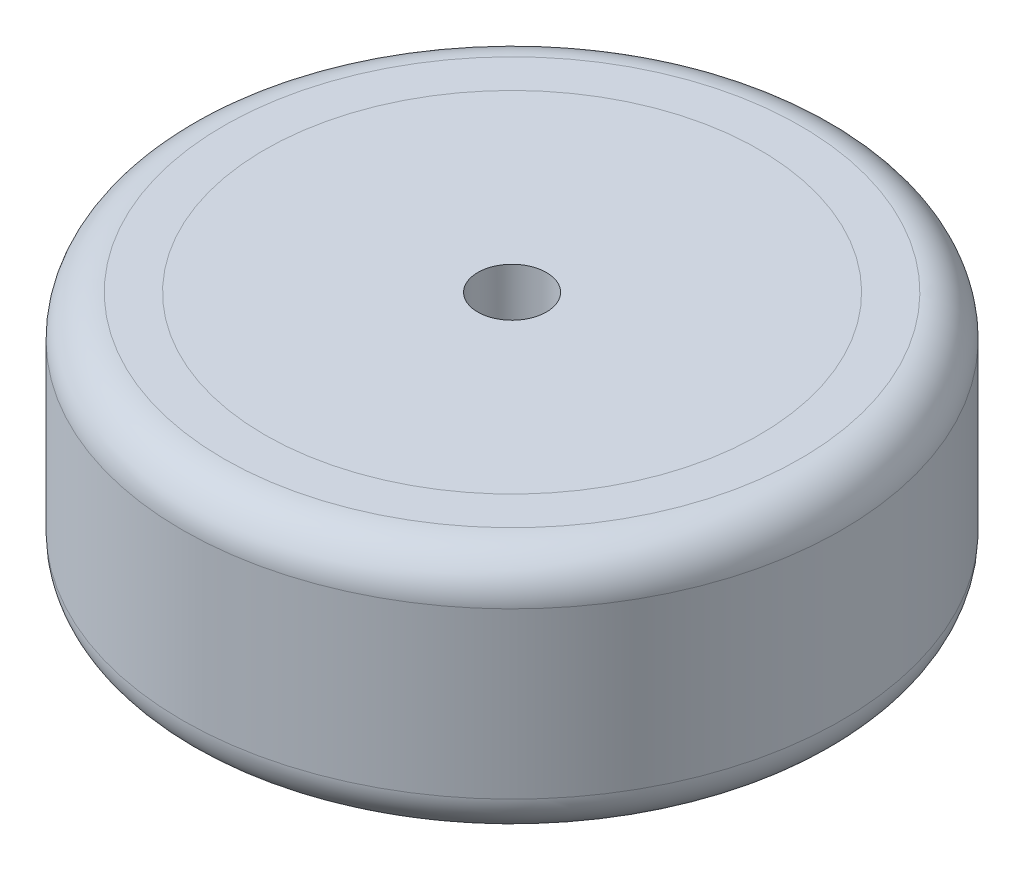
ISO-10303-21;
HEADER;
FILE_DESCRIPTION(('STEP AP214'),'2;1');
FILE_NAME('part.step','',(''),(''),'','','');
FILE_SCHEMA(('AUTOMOTIVE_DESIGN { 1 0 10303 214 1 1 1 1 }'));
ENDSEC;
DATA;
#1=APPLICATION_CONTEXT('core data for automotive mechanical design processes');
#2=APPLICATION_PROTOCOL_DEFINITION('international standard','automotive_design',2000,#1);
#3=PRODUCT_CONTEXT('',#1,'mechanical');
#4=PRODUCT('Part','Part','',(#3));
#5=PRODUCT_RELATED_PRODUCT_CATEGORY('part','',(#4));
#6=PRODUCT_DEFINITION_FORMATION('','',#4);
#7=PRODUCT_DEFINITION_CONTEXT('part definition',#1,'design');
#8=PRODUCT_DEFINITION('design','',#6,#7);
#9=PRODUCT_DEFINITION_SHAPE('','',#8);
#10=(LENGTH_UNIT() NAMED_UNIT(*) SI_UNIT(.MILLI.,.METRE.));
#11=(NAMED_UNIT(*) PLANE_ANGLE_UNIT() SI_UNIT($,.RADIAN.));
#12=(NAMED_UNIT(*) SI_UNIT($,.STERADIAN.) SOLID_ANGLE_UNIT());
#13=UNCERTAINTY_MEASURE_WITH_UNIT(LENGTH_MEASURE(1.E-05),#10,'distance_accuracy_value','');
#14=(GEOMETRIC_REPRESENTATION_CONTEXT(3) GLOBAL_UNCERTAINTY_ASSIGNED_CONTEXT((#13)) GLOBAL_UNIT_ASSIGNED_CONTEXT((#10,
#11,#12)) REPRESENTATION_CONTEXT('',''));
#15=CARTESIAN_POINT('',(0.,0.,0.));
#16=DIRECTION('',(0.,0.,1.));
#17=DIRECTION('',(1.,0.,0.));
#18=AXIS2_PLACEMENT_3D('',#15,#16,#17);
#19=CARTESIAN_POINT('',(0.,0.,0.));
#20=DIRECTION('',(0.,1.,0.));
#21=DIRECTION('',(0.,0.,1.));
#22=AXIS2_PLACEMENT_3D('',#19,#20,#21);
#23=CYLINDRICAL_SURFACE('',#22,18.);
#24=CARTESIAN_POINT('',(0.,0.,0.));
#25=DIRECTION('',(0.,-1.,0.));
#26=DIRECTION('',(0.,0.,-1.));
#27=AXIS2_PLACEMENT_3D('',#24,#25,#26);
#28=CIRCLE('',#27,18.);
#29=CARTESIAN_POINT('',(0.,0.,-18.));
#30=VERTEX_POINT('',#29);
#31=EDGE_CURVE('E11',#30,#30,#28,.T.);
#32=ORIENTED_EDGE('',*,*,#31,.F.);
#33=EDGE_LOOP('',(#32));
#34=FACE_BOUND('',#33,.T.);
#35=CARTESIAN_POINT('',(0.,5.,0.));
#36=DIRECTION('',(0.,-1.,0.));
#37=DIRECTION('',(0.,0.,-1.));
#38=AXIS2_PLACEMENT_3D('',#35,#36,#37);
#39=CIRCLE('',#38,18.);
#40=CARTESIAN_POINT('',(0.,5.,-18.));
#41=VERTEX_POINT('',#40);
#42=EDGE_CURVE('E51',#41,#41,#39,.T.);
#43=ORIENTED_EDGE('',*,*,#42,.T.);
#44=EDGE_LOOP('',(#43));
#45=FACE_BOUND('',#44,.T.);
#46=ADVANCED_FACE('F44',(#34,#45),#23,.T.);
#47=CARTESIAN_POINT('',(0.,0.,0.));
#48=DIRECTION('',(0.,-1.,0.));
#49=DIRECTION('',(0.,0.,-1.));
#50=AXIS2_PLACEMENT_3D('',#47,#48,#49);
#51=PLANE('',#50);
#52=CARTESIAN_POINT('',(0.,0.,0.));
#53=DIRECTION('',(0.,-1.,0.));
#54=DIRECTION('',(0.,0.,-1.));
#55=AXIS2_PLACEMENT_3D('',#52,#53,#54);
#56=CIRCLE('',#55,2.5);
#57=CARTESIAN_POINT('',(0.,0.,-2.5));
#58=VERTEX_POINT('',#57);
#59=EDGE_CURVE('E57',#58,#58,#56,.T.);
#60=ORIENTED_EDGE('',*,*,#59,.F.);
#61=EDGE_LOOP('',(#60));
#62=FACE_BOUND('',#61,.T.);
#63=ORIENTED_EDGE('',*,*,#31,.T.);
#64=EDGE_LOOP('',(#63));
#65=FACE_BOUND('',#64,.T.);
#66=ADVANCED_FACE('F73',(#62,#65),#51,.T.);
#67=CARTESIAN_POINT('',(0.,5.,0.));
#68=DIRECTION('',(0.,-1.,0.));
#69=DIRECTION('',(0.,0.,-1.));
#70=AXIS2_PLACEMENT_3D('',#67,#68,#69);
#71=PLANE('',#70);
#72=CARTESIAN_POINT('',(0.,5.,0.));
#73=DIRECTION('',(0.,-1.,0.));
#74=DIRECTION('',(0.,0.,-1.));
#75=AXIS2_PLACEMENT_3D('',#72,#73,#74);
#76=CIRCLE('',#75,2.5);
#77=CARTESIAN_POINT('',(0.,5.,-2.5));
#78=VERTEX_POINT('',#77);
#79=EDGE_CURVE('E47',#78,#78,#76,.T.);
#80=ORIENTED_EDGE('',*,*,#79,.T.);
#81=EDGE_LOOP('',(#80));
#82=FACE_BOUND('',#81,.T.);
#83=ORIENTED_EDGE('',*,*,#42,.F.);
#84=EDGE_LOOP('',(#83));
#85=FACE_BOUND('',#84,.T.);
#86=ADVANCED_FACE('F64',(#82,#85),#71,.F.);
#87=CARTESIAN_POINT('',(0.,18.,0.));
#88=DIRECTION('',(0.,-1.,0.));
#89=DIRECTION('',(0.,0.,-1.));
#90=AXIS2_PLACEMENT_3D('',#87,#88,#89);
#91=CYLINDRICAL_SURFACE('',#90,2.5);
#92=ORIENTED_EDGE('',*,*,#59,.T.);
#93=EDGE_LOOP('',(#92));
#94=FACE_BOUND('',#93,.T.);
#95=ORIENTED_EDGE('',*,*,#79,.F.);
#96=EDGE_LOOP('',(#95));
#97=FACE_BOUND('',#96,.T.);
#98=ADVANCED_FACE('F67',(#94,#97),#91,.F.);
#99=CLOSED_SHELL('',(#46,#66,#86,#98));
#100=MANIFOLD_SOLID_BREP('B2',#99);
#101=CARTESIAN_POINT('',(0.,18.,0.));
#102=DIRECTION('',(0.,-1.,0.));
#103=DIRECTION('',(0.,0.,-1.));
#104=AXIS2_PLACEMENT_3D('',#101,#102,#103);
#105=CYLINDRICAL_SURFACE('',#104,18.);
#106=CARTESIAN_POINT('',(0.,18.,0.));
#107=DIRECTION('',(0.,1.,0.));
#108=DIRECTION('',(0.,0.,1.));
#109=AXIS2_PLACEMENT_3D('',#106,#107,#108);
#110=CIRCLE('',#109,18.);
#111=CARTESIAN_POINT('',(0.,18.,18.));
#112=VERTEX_POINT('',#111);
#113=EDGE_CURVE('E43',#112,#112,#110,.T.);
#114=ORIENTED_EDGE('',*,*,#113,.F.);
#115=EDGE_LOOP('',(#114));
#116=FACE_BOUND('',#115,.T.);
#117=CARTESIAN_POINT('',(0.,13.,0.));
#118=DIRECTION('',(0.,1.,0.));
#119=DIRECTION('',(0.,0.,1.));
#120=AXIS2_PLACEMENT_3D('',#117,#118,#119);
#121=CIRCLE('',#120,18.);
#122=CARTESIAN_POINT('',(0.,13.,18.));
#123=VERTEX_POINT('',#122);
#124=EDGE_CURVE('E128',#123,#123,#121,.T.);
#125=ORIENTED_EDGE('',*,*,#124,.T.);
#126=EDGE_LOOP('',(#125));
#127=FACE_BOUND('',#126,.T.);
#128=ADVANCED_FACE('F121',(#116,#127),#105,.T.);
#129=CARTESIAN_POINT('',(0.,18.,0.));
#130=DIRECTION('',(0.,1.,0.));
#131=DIRECTION('',(0.,0.,1.));
#132=AXIS2_PLACEMENT_3D('',#129,#130,#131);
#133=PLANE('',#132);
#134=CARTESIAN_POINT('',(0.,18.,0.));
#135=DIRECTION('',(0.,-1.,0.));
#136=DIRECTION('',(0.,0.,-1.));
#137=AXIS2_PLACEMENT_3D('',#134,#135,#136);
#138=CIRCLE('',#137,2.5);
#139=CARTESIAN_POINT('',(0.,18.,-2.5));
#140=VERTEX_POINT('',#139);
#141=EDGE_CURVE('E134',#140,#140,#138,.T.);
#142=ORIENTED_EDGE('',*,*,#141,.T.);
#143=EDGE_LOOP('',(#142));
#144=FACE_BOUND('',#143,.T.);
#145=ORIENTED_EDGE('',*,*,#113,.T.);
#146=EDGE_LOOP('',(#145));
#147=FACE_BOUND('',#146,.T.);
#148=ADVANCED_FACE('F151',(#144,#147),#133,.T.);
#149=CARTESIAN_POINT('',(0.,13.,0.));
#150=DIRECTION('',(0.,1.,0.));
#151=DIRECTION('',(0.,0.,1.));
#152=AXIS2_PLACEMENT_3D('',#149,#150,#151);
#153=PLANE('',#152);
#154=CARTESIAN_POINT('',(0.,13.,0.));
#155=DIRECTION('',(0.,1.,0.));
#156=DIRECTION('',(0.,0.,1.));
#157=AXIS2_PLACEMENT_3D('',#154,#155,#156);
#158=CIRCLE('',#157,2.5);
#159=CARTESIAN_POINT('',(0.,13.,2.5));
#160=VERTEX_POINT('',#159);
#161=EDGE_CURVE('E124',#160,#160,#158,.T.);
#162=ORIENTED_EDGE('',*,*,#161,.T.);
#163=EDGE_LOOP('',(#162));
#164=FACE_BOUND('',#163,.T.);
#165=ORIENTED_EDGE('',*,*,#124,.F.);
#166=EDGE_LOOP('',(#165));
#167=FACE_BOUND('',#166,.T.);
#168=ADVANCED_FACE('F141',(#164,#167),#153,.F.);
#169=CARTESIAN_POINT('',(0.,18.,0.));
#170=DIRECTION('',(0.,-1.,0.));
#171=DIRECTION('',(0.,0.,-1.));
#172=AXIS2_PLACEMENT_3D('',#169,#170,#171);
#173=CYLINDRICAL_SURFACE('',#172,2.5);
#174=ORIENTED_EDGE('',*,*,#141,.F.);
#175=EDGE_LOOP('',(#174));
#176=FACE_BOUND('',#175,.T.);
#177=ORIENTED_EDGE('',*,*,#161,.F.);
#178=EDGE_LOOP('',(#177));
#179=FACE_BOUND('',#178,.T.);
#180=ADVANCED_FACE('F144',(#176,#179),#173,.F.);
#181=CLOSED_SHELL('',(#128,#148,#168,#180));
#182=MANIFOLD_SOLID_BREP('B6',#181);
#183=CARTESIAN_POINT('',(0.,18.,0.));
#184=DIRECTION('',(0.,-1.,0.));
#185=DIRECTION('',(0.,0.,-1.));
#186=AXIS2_PLACEMENT_3D('',#183,#184,#185);
#187=CYLINDRICAL_SURFACE('',#186,24.);
#188=CARTESIAN_POINT('',(0.,15.,0.));
#189=DIRECTION('',(0.,1.,0.));
#190=DIRECTION('',(0.,0.,1.));
#191=AXIS2_PLACEMENT_3D('',#188,#189,#190);
#192=CIRCLE('',#191,24.);
#193=CARTESIAN_POINT('',(0.,15.,24.));
#194=VERTEX_POINT('',#193);
#195=EDGE_CURVE('E198',#194,#194,#192,.F.);
#196=ORIENTED_EDGE('',*,*,#195,.T.);
#197=EDGE_LOOP('',(#196));
#198=FACE_BOUND('',#197,.T.);
#199=CARTESIAN_POINT('',(0.,3.,0.));
#200=DIRECTION('',(0.,1.,0.));
#201=DIRECTION('',(0.,0.,1.));
#202=AXIS2_PLACEMENT_3D('',#199,#200,#201);
#203=CIRCLE('',#202,24.);
#204=CARTESIAN_POINT('',(0.,3.,24.));
#205=VERTEX_POINT('',#204);
#206=EDGE_CURVE('E202',#205,#205,#203,.T.);
#207=ORIENTED_EDGE('',*,*,#206,.T.);
#208=EDGE_LOOP('',(#207));
#209=FACE_BOUND('',#208,.T.);
#210=ADVANCED_FACE('F191',(#198,#209),#187,.T.);
#211=CARTESIAN_POINT('',(0.,18.,0.));
#212=DIRECTION('',(0.,1.,0.));
#213=DIRECTION('',(0.,0.,1.));
#214=AXIS2_PLACEMENT_3D('',#211,#212,#213);
#215=PLANE('',#214);
#216=CARTESIAN_POINT('',(0.,18.,0.));
#217=DIRECTION('',(0.,1.,0.));
#218=DIRECTION('',(0.,0.,1.));
#219=AXIS2_PLACEMENT_3D('',#216,#217,#218);
#220=CIRCLE('',#219,21.);
#221=CARTESIAN_POINT('',(0.,18.,21.));
#222=VERTEX_POINT('',#221);
#223=EDGE_CURVE('E206',#222,#222,#220,.T.);
#224=ORIENTED_EDGE('',*,*,#223,.T.);
#225=EDGE_LOOP('',(#224));
#226=FACE_BOUND('',#225,.T.);
#227=CARTESIAN_POINT('',(0.,18.,0.));
#228=DIRECTION('',(0.,1.,0.));
#229=DIRECTION('',(0.,0.,1.));
#230=AXIS2_PLACEMENT_3D('',#227,#228,#229);
#231=CIRCLE('',#230,18.);
#232=CARTESIAN_POINT('',(0.,18.,18.));
#233=VERTEX_POINT('',#232);
#234=EDGE_CURVE('E216',#233,#233,#231,.T.);
#235=ORIENTED_EDGE('',*,*,#234,.F.);
#236=EDGE_LOOP('',(#235));
#237=FACE_BOUND('',#236,.T.);
#238=ADVANCED_FACE('F247',(#226,#237),#215,.T.);
#239=CARTESIAN_POINT('',(0.,0.,0.));
#240=DIRECTION('',(0.,1.,0.));
#241=DIRECTION('',(0.,0.,1.));
#242=AXIS2_PLACEMENT_3D('',#239,#240,#241);
#243=PLANE('',#242);
#244=CARTESIAN_POINT('',(0.,0.,0.));
#245=DIRECTION('',(0.,1.,0.));
#246=DIRECTION('',(0.,0.,1.));
#247=AXIS2_PLACEMENT_3D('',#244,#245,#246);
#248=CIRCLE('',#247,21.);
#249=CARTESIAN_POINT('',(0.,0.,21.));
#250=VERTEX_POINT('',#249);
#251=EDGE_CURVE('E120',#250,#250,#248,.F.);
#252=ORIENTED_EDGE('',*,*,#251,.T.);
#253=EDGE_LOOP('',(#252));
#254=FACE_BOUND('',#253,.T.);
#255=CARTESIAN_POINT('',(0.,0.,0.));
#256=DIRECTION('',(0.,-1.,0.));
#257=DIRECTION('',(0.,0.,-1.));
#258=AXIS2_PLACEMENT_3D('',#255,#256,#257);
#259=CIRCLE('',#258,18.);
#260=CARTESIAN_POINT('',(0.,0.,-18.));
#261=VERTEX_POINT('',#260);
#262=EDGE_CURVE('E222',#261,#261,#259,.T.);
#263=ORIENTED_EDGE('',*,*,#262,.F.);
#264=EDGE_LOOP('',(#263));
#265=FACE_BOUND('',#264,.T.);
#266=ADVANCED_FACE('F243',(#254,#265),#243,.F.);
#267=CARTESIAN_POINT('',(0.,13.,0.));
#268=DIRECTION('',(0.,1.,0.));
#269=DIRECTION('',(0.,0.,1.));
#270=AXIS2_PLACEMENT_3D('',#267,#268,#269);
#271=CYLINDRICAL_SURFACE('',#270,18.);
#272=CARTESIAN_POINT('',(0.,13.,0.));
#273=DIRECTION('',(0.,1.,0.));
#274=DIRECTION('',(0.,0.,1.));
#275=AXIS2_PLACEMENT_3D('',#272,#273,#274);
#276=CIRCLE('',#275,18.);
#277=CARTESIAN_POINT('',(0.,13.,18.));
#278=VERTEX_POINT('',#277);
#279=EDGE_CURVE('E211',#278,#278,#276,.T.);
#280=ORIENTED_EDGE('',*,*,#279,.F.);
#281=EDGE_LOOP('',(#280));
#282=FACE_BOUND('',#281,.T.);
#283=ORIENTED_EDGE('',*,*,#234,.T.);
#284=EDGE_LOOP('',(#283));
#285=FACE_BOUND('',#284,.T.);
#286=ADVANCED_FACE('F237',(#282,#285),#271,.F.);
#287=CARTESIAN_POINT('',(0.,13.,0.));
#288=DIRECTION('',(0.,1.,0.));
#289=DIRECTION('',(0.,0.,1.));
#290=AXIS2_PLACEMENT_3D('',#287,#288,#289);
#291=PLANE('',#290);
#292=CARTESIAN_POINT('',(0.,13.,0.));
#293=DIRECTION('',(0.,1.,0.));
#294=DIRECTION('',(0.,0.,1.));
#295=AXIS2_PLACEMENT_3D('',#292,#293,#294);
#296=CIRCLE('',#295,2.5);
#297=CARTESIAN_POINT('',(0.,13.,2.5));
#298=VERTEX_POINT('',#297);
#299=EDGE_CURVE('E215',#298,#298,#296,.T.);
#300=ORIENTED_EDGE('',*,*,#299,.F.);
#301=EDGE_LOOP('',(#300));
#302=FACE_BOUND('',#301,.T.);
#303=ORIENTED_EDGE('',*,*,#279,.T.);
#304=EDGE_LOOP('',(#303));
#305=FACE_BOUND('',#304,.T.);
#306=ADVANCED_FACE('F233',(#302,#305),#291,.T.);
#307=CARTESIAN_POINT('',(0.,5.,0.));
#308=DIRECTION('',(0.,-1.,0.));
#309=DIRECTION('',(0.,0.,-1.));
#310=AXIS2_PLACEMENT_3D('',#307,#308,#309);
#311=CYLINDRICAL_SURFACE('',#310,18.);
#312=CARTESIAN_POINT('',(0.,5.,0.));
#313=DIRECTION('',(0.,-1.,0.));
#314=DIRECTION('',(0.,0.,-1.));
#315=AXIS2_PLACEMENT_3D('',#312,#313,#314);
#316=CIRCLE('',#315,18.);
#317=CARTESIAN_POINT('',(0.,5.,-18.));
#318=VERTEX_POINT('',#317);
#319=EDGE_CURVE('E219',#318,#318,#316,.T.);
#320=ORIENTED_EDGE('',*,*,#319,.F.);
#321=EDGE_LOOP('',(#320));
#322=FACE_BOUND('',#321,.T.);
#323=ORIENTED_EDGE('',*,*,#262,.T.);
#324=EDGE_LOOP('',(#323));
#325=FACE_BOUND('',#324,.T.);
#326=ADVANCED_FACE('F236',(#322,#325),#311,.F.);
#327=CARTESIAN_POINT('',(0.,5.,0.));
#328=DIRECTION('',(0.,-1.,0.));
#329=DIRECTION('',(0.,0.,-1.));
#330=AXIS2_PLACEMENT_3D('',#327,#328,#329);
#331=PLANE('',#330);
#332=CARTESIAN_POINT('',(0.,5.,0.));
#333=DIRECTION('',(0.,-1.,0.));
#334=DIRECTION('',(0.,0.,-1.));
#335=AXIS2_PLACEMENT_3D('',#332,#333,#334);
#336=CIRCLE('',#335,2.5);
#337=CARTESIAN_POINT('',(0.,5.,-2.5));
#338=VERTEX_POINT('',#337);
#339=EDGE_CURVE('E212',#338,#338,#336,.T.);
#340=ORIENTED_EDGE('',*,*,#339,.F.);
#341=EDGE_LOOP('',(#340));
#342=FACE_BOUND('',#341,.T.);
#343=ORIENTED_EDGE('',*,*,#319,.T.);
#344=EDGE_LOOP('',(#343));
#345=FACE_BOUND('',#344,.T.);
#346=ADVANCED_FACE('F265',(#342,#345),#331,.T.);
#347=CARTESIAN_POINT('',(0.,18.,0.));
#348=DIRECTION('',(0.,-1.,0.));
#349=DIRECTION('',(0.,0.,-1.));
#350=AXIS2_PLACEMENT_3D('',#347,#348,#349);
#351=CYLINDRICAL_SURFACE('',#350,2.5);
#352=ORIENTED_EDGE('',*,*,#299,.T.);
#353=EDGE_LOOP('',(#352));
#354=FACE_BOUND('',#353,.T.);
#355=ORIENTED_EDGE('',*,*,#339,.T.);
#356=EDGE_LOOP('',(#355));
#357=FACE_BOUND('',#356,.T.);
#358=ADVANCED_FACE('F230',(#354,#357),#351,.F.);
#359=CARTESIAN_POINT('',(0.,15.,0.));
#360=DIRECTION('',(0.,1.,0.));
#361=DIRECTION('',(0.,0.,1.));
#362=AXIS2_PLACEMENT_3D('',#359,#360,#361);
#363=TOROIDAL_SURFACE('',#362,21.,3.);
#364=ORIENTED_EDGE('',*,*,#195,.F.);
#365=EDGE_LOOP('',(#364));
#366=FACE_BOUND('',#365,.T.);
#367=ORIENTED_EDGE('',*,*,#223,.F.);
#368=EDGE_LOOP('',(#367));
#369=FACE_BOUND('',#368,.T.);
#370=ADVANCED_FACE('F257',(#366,#369),#363,.T.);
#371=CARTESIAN_POINT('',(0.,3.,0.));
#372=DIRECTION('',(0.,1.,0.));
#373=DIRECTION('',(0.,0.,1.));
#374=AXIS2_PLACEMENT_3D('',#371,#372,#373);
#375=TOROIDAL_SURFACE('',#374,21.,3.);
#376=ORIENTED_EDGE('',*,*,#251,.F.);
#377=EDGE_LOOP('',(#376));
#378=FACE_BOUND('',#377,.T.);
#379=ORIENTED_EDGE('',*,*,#206,.F.);
#380=EDGE_LOOP('',(#379));
#381=FACE_BOUND('',#380,.T.);
#382=ADVANCED_FACE('F193',(#378,#381),#375,.T.);
#383=CLOSED_SHELL('',(#210,#238,#266,#286,#306,#326,#346,#358,#370,#382));
#384=MANIFOLD_SOLID_BREP('B38',#383);
#385=ADVANCED_BREP_SHAPE_REPRESENTATION('',(#18,#100,#182,#384),#14);
#386=SHAPE_DEFINITION_REPRESENTATION(#9,#385);
ENDSEC;
END-ISO-10303-21;
